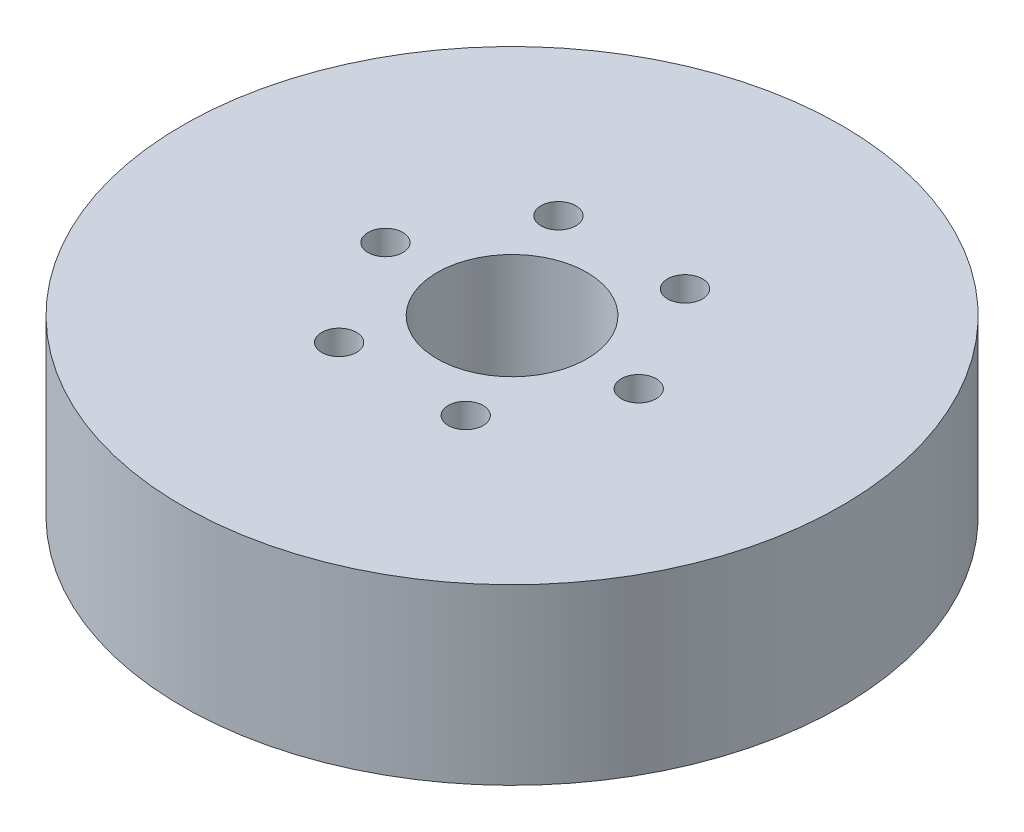
ISO-10303-21;
HEADER;
FILE_DESCRIPTION(('STEP AP214'),'2;1');
FILE_NAME('part.step','',(''),(''),'','','');
FILE_SCHEMA(('AUTOMOTIVE_DESIGN { 1 0 10303 214 1 1 1 1 }'));
ENDSEC;
DATA;
#1=APPLICATION_CONTEXT('core data for automotive mechanical design processes');
#2=APPLICATION_PROTOCOL_DEFINITION('international standard','automotive_design',2000,#1);
#3=PRODUCT_CONTEXT('',#1,'mechanical');
#4=PRODUCT('Part','Part','',(#3));
#5=PRODUCT_RELATED_PRODUCT_CATEGORY('part','',(#4));
#6=PRODUCT_DEFINITION_FORMATION('','',#4);
#7=PRODUCT_DEFINITION_CONTEXT('part definition',#1,'design');
#8=PRODUCT_DEFINITION('design','',#6,#7);
#9=PRODUCT_DEFINITION_SHAPE('','',#8);
#10=(LENGTH_UNIT() NAMED_UNIT(*) SI_UNIT(.MILLI.,.METRE.));
#11=(NAMED_UNIT(*) PLANE_ANGLE_UNIT() SI_UNIT($,.RADIAN.));
#12=(NAMED_UNIT(*) SI_UNIT($,.STERADIAN.) SOLID_ANGLE_UNIT());
#13=UNCERTAINTY_MEASURE_WITH_UNIT(LENGTH_MEASURE(1.E-05),#10,'distance_accuracy_value','');
#14=(GEOMETRIC_REPRESENTATION_CONTEXT(3) GLOBAL_UNCERTAINTY_ASSIGNED_CONTEXT((#13)) GLOBAL_UNIT_ASSIGNED_CONTEXT((#10,
#11,#12)) REPRESENTATION_CONTEXT('',''));
#15=CARTESIAN_POINT('',(0.,0.,0.));
#16=DIRECTION('',(0.,0.,1.));
#17=DIRECTION('',(1.,0.,0.));
#18=AXIS2_PLACEMENT_3D('',#15,#16,#17);
#19=CARTESIAN_POINT('',(0.,29.,0.));
#20=DIRECTION('',(0.,-1.,0.));
#21=DIRECTION('',(0.,0.,-1.));
#22=AXIS2_PLACEMENT_3D('',#19,#20,#21);
#23=CYLINDRICAL_SURFACE('',#22,55.);
#24=CARTESIAN_POINT('',(0.,29.,0.));
#25=DIRECTION('',(0.,1.,0.));
#26=DIRECTION('',(0.,0.,1.));
#27=AXIS2_PLACEMENT_3D('',#24,#25,#26);
#28=CIRCLE('',#27,55.);
#29=CARTESIAN_POINT('',(0.,29.,-55.));
#30=VERTEX_POINT('',#29);
#31=EDGE_CURVE('E10',#30,#30,#28,.T.);
#32=CARTESIAN_POINT('',(0.,0.,0.));
#33=DIRECTION('',(0.,1.,0.));
#34=DIRECTION('',(0.,0.,1.));
#35=AXIS2_PLACEMENT_3D('',#32,#33,#34);
#36=CIRCLE('',#35,55.);
#37=CARTESIAN_POINT('',(0.,0.,-55.));
#38=VERTEX_POINT('',#37);
#39=EDGE_CURVE('E37',#38,#38,#36,.T.);
#40=CARTESIAN_POINT('',(0.,29.,-55.));
#41=CARTESIAN_POINT('',(0.,28.6979166666667,-55.));
#42=CARTESIAN_POINT('',(0.,28.3958333333333,-55.));
#43=CARTESIAN_POINT('',(0.,27.7916666666667,-55.));
#44=CARTESIAN_POINT('',(0.,27.4895833333333,-55.));
#45=CARTESIAN_POINT('',(0.,26.8854166666667,-55.));
#46=CARTESIAN_POINT('',(0.,26.5833333333333,-55.));
#47=CARTESIAN_POINT('',(0.,25.9791666666667,-55.));
#48=CARTESIAN_POINT('',(0.,25.6770833333333,-55.));
#49=CARTESIAN_POINT('',(0.,25.0729166666667,-55.));
#50=CARTESIAN_POINT('',(0.,24.7708333333333,-55.));
#51=CARTESIAN_POINT('',(0.,24.1666666666667,-55.));
#52=CARTESIAN_POINT('',(0.,23.8645833333333,-55.));
#53=CARTESIAN_POINT('',(0.,23.2604166666667,-55.));
#54=CARTESIAN_POINT('',(0.,22.9583333333333,-55.));
#55=CARTESIAN_POINT('',(0.,22.3541666666667,-55.));
#56=CARTESIAN_POINT('',(0.,22.0520833333333,-55.));
#57=CARTESIAN_POINT('',(0.,21.4479166666667,-55.));
#58=CARTESIAN_POINT('',(0.,21.1458333333333,-55.));
#59=CARTESIAN_POINT('',(0.,20.5416666666667,-55.));
#60=CARTESIAN_POINT('',(0.,20.2395833333333,-55.));
#61=CARTESIAN_POINT('',(0.,19.6354166666667,-55.));
#62=CARTESIAN_POINT('',(0.,19.3333333333333,-55.));
#63=CARTESIAN_POINT('',(0.,18.7291666666667,-55.));
#64=CARTESIAN_POINT('',(0.,18.4270833333333,-55.));
#65=CARTESIAN_POINT('',(0.,17.8229166666667,-55.));
#66=CARTESIAN_POINT('',(0.,17.5208333333333,-55.));
#67=CARTESIAN_POINT('',(0.,16.9166666666667,-55.));
#68=CARTESIAN_POINT('',(0.,16.6145833333333,-55.));
#69=CARTESIAN_POINT('',(0.,16.0104166666667,-55.));
#70=CARTESIAN_POINT('',(0.,15.7083333333333,-55.));
#71=CARTESIAN_POINT('',(0.,15.1041666666667,-55.));
#72=CARTESIAN_POINT('',(0.,14.8020833333333,-55.));
#73=CARTESIAN_POINT('',(0.,14.1979166666667,-55.));
#74=CARTESIAN_POINT('',(0.,13.8958333333333,-55.));
#75=CARTESIAN_POINT('',(0.,13.2916666666667,-55.));
#76=CARTESIAN_POINT('',(0.,12.9895833333333,-55.));
#77=CARTESIAN_POINT('',(0.,12.3854166666667,-55.));
#78=CARTESIAN_POINT('',(0.,12.0833333333333,-55.));
#79=CARTESIAN_POINT('',(0.,11.4791666666667,-55.));
#80=CARTESIAN_POINT('',(0.,11.1770833333333,-55.));
#81=CARTESIAN_POINT('',(0.,10.5729166666667,-55.));
#82=CARTESIAN_POINT('',(0.,10.2708333333333,-55.));
#83=CARTESIAN_POINT('',(0.,9.66666666666667,-55.));
#84=CARTESIAN_POINT('',(0.,9.36458333333333,-55.));
#85=CARTESIAN_POINT('',(0.,8.76041666666667,-55.));
#86=CARTESIAN_POINT('',(0.,8.45833333333333,-55.));
#87=CARTESIAN_POINT('',(0.,7.85416666666667,-55.));
#88=CARTESIAN_POINT('',(0.,7.55208333333333,-55.));
#89=CARTESIAN_POINT('',(0.,6.94791666666667,-55.));
#90=CARTESIAN_POINT('',(0.,6.64583333333333,-55.));
#91=CARTESIAN_POINT('',(0.,6.04166666666667,-55.));
#92=CARTESIAN_POINT('',(0.,5.73958333333333,-55.));
#93=CARTESIAN_POINT('',(0.,5.13541666666667,-55.));
#94=CARTESIAN_POINT('',(0.,4.83333333333333,-55.));
#95=CARTESIAN_POINT('',(0.,4.22916666666667,-55.));
#96=CARTESIAN_POINT('',(0.,3.92708333333333,-55.));
#97=CARTESIAN_POINT('',(0.,3.32291666666667,-55.));
#98=CARTESIAN_POINT('',(0.,3.02083333333333,-55.));
#99=CARTESIAN_POINT('',(0.,2.41666666666667,-55.));
#100=CARTESIAN_POINT('',(0.,2.11458333333333,-55.));
#101=CARTESIAN_POINT('',(0.,1.51041666666667,-55.));
#102=CARTESIAN_POINT('',(0.,1.20833333333333,-55.));
#103=CARTESIAN_POINT('',(0.,0.604166666666667,-55.));
#104=CARTESIAN_POINT('',(0.,0.302083333333333,-55.));
#105=CARTESIAN_POINT('',(0.,0.,-55.));
#106=B_SPLINE_CURVE_WITH_KNOTS('',3,(#40,#41,#42,#43,#44,#45,#46,#47,#48,#49,#50,#51,#52,#53,
#54,#55,#56,#57,#58,#59,#60,#61,#62,#63,#64,#65,#66,#67,#68,#69,#70,#71,#72,#73,#74,#75,#76,#77,
#78,#79,#80,#81,#82,#83,#84,#85,#86,#87,#88,#89,#90,#91,#92,#93,#94,#95,#96,#97,#98,#99,#100,
#101,#102,#103,#104,#105),.UNSPECIFIED.,.F.,.F.,(4,2,2,2,2,2,2,2,2,2,2,2,2,2,2,2,2,2,2,2,2,2,2,
2,2,2,2,2,2,2,2,2,4),(0.,0.906250000000001,1.8125,2.71875,3.625,4.53125,5.4375,6.34375,7.25,
8.15625,9.0625,9.96875,10.875,11.78125,12.6875,13.59375,14.5,15.40625,16.3125,17.21875,18.125,
19.03125,19.9375,20.84375,21.75,22.65625,23.5625,24.46875,25.375,26.28125,27.1875,28.09375,29.),.UNSPECIFIED.);
#107=EDGE_CURVE('BSEAM40',#30,#38,#106,.T.);
#108=ORIENTED_EDGE('',*,*,#31,.F.);
#109=ORIENTED_EDGE('',*,*,#39,.T.);
#110=ORIENTED_EDGE('',*,*,#107,.T.);
#111=ORIENTED_EDGE('',*,*,#107,.F.);
#112=EDGE_LOOP('',(#108,#110,#109,#111));
#113=FACE_BOUND('',#112,.T.);
#114=ADVANCED_FACE('F40',(#113),#23,.T.);
#115=CARTESIAN_POINT('',(0.,29.,0.));
#116=DIRECTION('',(0.,1.,0.));
#117=DIRECTION('',(0.,0.,1.));
#118=AXIS2_PLACEMENT_3D('',#115,#116,#117);
#119=PLANE('',#118);
#120=CARTESIAN_POINT('',(-10.5650806041825,29.,-18.2992563925041));
#121=DIRECTION('',(0.,1.,0.));
#122=DIRECTION('',(-0.866025403784433,0.,0.50000000000001));
#123=AXIS2_PLACEMENT_3D('',#120,#121,#122);
#124=CIRCLE('',#123,2.91067719214933);
#125=CARTESIAN_POINT('',(-13.0858009947998,29.,-16.8439177964294));
#126=VERTEX_POINT('',#125);
#127=EDGE_CURVE('E70',#126,#126,#124,.T.);
#128=ORIENTED_EDGE('',*,*,#127,.F.);
#129=EDGE_LOOP('',(#128));
#130=FACE_BOUND('',#129,.T.);
#131=CARTESIAN_POINT('',(10.5650806041821,29.,-18.2992563925043));
#132=DIRECTION('',(0.,1.,0.));
#133=DIRECTION('',(-0.866025403784443,0.,-0.499999999999992));
#134=AXIS2_PLACEMENT_3D('',#131,#132,#133);
#135=CIRCLE('',#134,2.91067719214933);
#136=CARTESIAN_POINT('',(8.04436021356485,29.,-19.754594988579));
#137=VERTEX_POINT('',#136);
#138=EDGE_CURVE('E71',#137,#137,#135,.T.);
#139=ORIENTED_EDGE('',*,*,#138,.F.);
#140=EDGE_LOOP('',(#139));
#141=FACE_BOUND('',#140,.T.);
#142=CARTESIAN_POINT('',(21.1301612083646,29.,0.));
#143=DIRECTION('',(0.,1.,0.));
#144=DIRECTION('',(0.,0.,-1.));
#145=AXIS2_PLACEMENT_3D('',#142,#143,#144);
#146=CIRCLE('',#145,2.91067719214933);
#147=CARTESIAN_POINT('',(21.1301612083646,29.,-2.91067719214933));
#148=VERTEX_POINT('',#147);
#149=EDGE_CURVE('E78',#148,#148,#146,.T.);
#150=ORIENTED_EDGE('',*,*,#149,.F.);
#151=EDGE_LOOP('',(#150));
#152=FACE_BOUND('',#151,.T.);
#153=CARTESIAN_POINT('',(10.5650806041824,29.,18.2992563925042));
#154=DIRECTION('',(0.,1.,0.));
#155=DIRECTION('',(0.866025403784436,0.,-0.500000000000004));
#156=AXIS2_PLACEMENT_3D('',#153,#154,#155);
#157=CIRCLE('',#156,2.91067719214933);
#158=CARTESIAN_POINT('',(13.0858009947997,29.,16.8439177964295));
#159=VERTEX_POINT('',#158);
#160=EDGE_CURVE('E84',#159,#159,#157,.T.);
#161=ORIENTED_EDGE('',*,*,#160,.F.);
#162=EDGE_LOOP('',(#161));
#163=FACE_BOUND('',#162,.T.);
#164=CARTESIAN_POINT('',(-10.5650806041823,29.,18.2992563925043));
#165=DIRECTION('',(0.,1.,0.));
#166=DIRECTION('',(0.86602540378444,0.,0.499999999999998));
#167=AXIS2_PLACEMENT_3D('',#164,#165,#166);
#168=CIRCLE('',#167,2.91067719214933);
#169=CARTESIAN_POINT('',(-8.04436021356499,29.,19.7545949885789));
#170=VERTEX_POINT('',#169);
#171=EDGE_CURVE('E61',#170,#170,#168,.T.);
#172=ORIENTED_EDGE('',*,*,#171,.F.);
#173=EDGE_LOOP('',(#172));
#174=FACE_BOUND('',#173,.T.);
#175=CARTESIAN_POINT('',(-21.1301612083646,29.,0.));
#176=DIRECTION('',(0.,1.,0.));
#177=DIRECTION('',(0.,0.,1.));
#178=AXIS2_PLACEMENT_3D('',#175,#176,#177);
#179=CIRCLE('',#178,2.91067719214933);
#180=CARTESIAN_POINT('',(-21.1301612083646,29.,2.91067719214933));
#181=VERTEX_POINT('',#180);
#182=EDGE_CURVE('E54',#181,#181,#179,.T.);
#183=ORIENTED_EDGE('',*,*,#182,.F.);
#184=EDGE_LOOP('',(#183));
#185=FACE_BOUND('',#184,.T.);
#186=CARTESIAN_POINT('',(0.,29.,0.));
#187=DIRECTION('',(0.,1.,0.));
#188=DIRECTION('',(0.,0.,1.));
#189=AXIS2_PLACEMENT_3D('',#186,#187,#188);
#190=CIRCLE('',#189,12.5);
#191=CARTESIAN_POINT('',(0.,29.,-12.5));
#192=VERTEX_POINT('',#191);
#193=EDGE_CURVE('E50',#192,#192,#190,.T.);
#194=ORIENTED_EDGE('',*,*,#193,.F.);
#195=EDGE_LOOP('',(#194));
#196=FACE_BOUND('',#195,.T.);
#197=ORIENTED_EDGE('',*,*,#31,.T.);
#198=EDGE_LOOP('',(#197));
#199=FACE_BOUND('',#198,.T.);
#200=ADVANCED_FACE('F99',(#130,#141,#152,#163,#174,#185,#196,#199),#119,.T.);
#201=CARTESIAN_POINT('',(0.,0.,0.));
#202=DIRECTION('',(0.,1.,0.));
#203=DIRECTION('',(0.,0.,1.));
#204=AXIS2_PLACEMENT_3D('',#201,#202,#203);
#205=PLANE('',#204);
#206=CARTESIAN_POINT('',(0.,0.,0.));
#207=DIRECTION('',(0.,1.,0.));
#208=DIRECTION('',(0.,0.,1.));
#209=AXIS2_PLACEMENT_3D('',#206,#207,#208);
#210=CIRCLE('',#209,12.5);
#211=CARTESIAN_POINT('',(0.,0.,-12.5));
#212=VERTEX_POINT('',#211);
#213=EDGE_CURVE('E47',#212,#212,#210,.T.);
#214=ORIENTED_EDGE('',*,*,#213,.T.);
#215=EDGE_LOOP('',(#214));
#216=FACE_BOUND('',#215,.T.);
#217=ORIENTED_EDGE('',*,*,#39,.F.);
#218=EDGE_LOOP('',(#217));
#219=FACE_BOUND('',#218,.T.);
#220=ADVANCED_FACE('F103',(#216,#219),#205,.F.);
#221=CARTESIAN_POINT('',(0.,29.,0.));
#222=DIRECTION('',(0.,-1.,0.));
#223=DIRECTION('',(0.,0.,-1.));
#224=AXIS2_PLACEMENT_3D('',#221,#222,#223);
#225=CYLINDRICAL_SURFACE('',#224,12.5);
#226=CARTESIAN_POINT('',(0.,29.,-12.5));
#227=CARTESIAN_POINT('',(0.,28.6979166666667,-12.5));
#228=CARTESIAN_POINT('',(0.,28.3958333333333,-12.5));
#229=CARTESIAN_POINT('',(0.,27.7916666666667,-12.5));
#230=CARTESIAN_POINT('',(0.,27.4895833333333,-12.5));
#231=CARTESIAN_POINT('',(0.,26.8854166666667,-12.5));
#232=CARTESIAN_POINT('',(0.,26.5833333333333,-12.5));
#233=CARTESIAN_POINT('',(0.,25.9791666666667,-12.5));
#234=CARTESIAN_POINT('',(0.,25.6770833333333,-12.5));
#235=CARTESIAN_POINT('',(0.,25.0729166666667,-12.5));
#236=CARTESIAN_POINT('',(0.,24.7708333333333,-12.5));
#237=CARTESIAN_POINT('',(0.,24.1666666666667,-12.5));
#238=CARTESIAN_POINT('',(0.,23.8645833333333,-12.5));
#239=CARTESIAN_POINT('',(0.,23.2604166666667,-12.5));
#240=CARTESIAN_POINT('',(0.,22.9583333333333,-12.5));
#241=CARTESIAN_POINT('',(0.,22.3541666666667,-12.5));
#242=CARTESIAN_POINT('',(0.,22.0520833333333,-12.5));
#243=CARTESIAN_POINT('',(0.,21.4479166666667,-12.5));
#244=CARTESIAN_POINT('',(0.,21.1458333333333,-12.5));
#245=CARTESIAN_POINT('',(0.,20.5416666666667,-12.5));
#246=CARTESIAN_POINT('',(0.,20.2395833333333,-12.5));
#247=CARTESIAN_POINT('',(0.,19.6354166666667,-12.5));
#248=CARTESIAN_POINT('',(0.,19.3333333333333,-12.5));
#249=CARTESIAN_POINT('',(0.,18.7291666666667,-12.5));
#250=CARTESIAN_POINT('',(0.,18.4270833333333,-12.5));
#251=CARTESIAN_POINT('',(0.,17.8229166666667,-12.5));
#252=CARTESIAN_POINT('',(0.,17.5208333333333,-12.5));
#253=CARTESIAN_POINT('',(0.,16.9166666666667,-12.5));
#254=CARTESIAN_POINT('',(0.,16.6145833333333,-12.5));
#255=CARTESIAN_POINT('',(0.,16.0104166666667,-12.5));
#256=CARTESIAN_POINT('',(0.,15.7083333333333,-12.5));
#257=CARTESIAN_POINT('',(0.,15.1041666666667,-12.5));
#258=CARTESIAN_POINT('',(0.,14.8020833333333,-12.5));
#259=CARTESIAN_POINT('',(0.,14.1979166666667,-12.5));
#260=CARTESIAN_POINT('',(0.,13.8958333333333,-12.5));
#261=CARTESIAN_POINT('',(0.,13.2916666666667,-12.5));
#262=CARTESIAN_POINT('',(0.,12.9895833333333,-12.5));
#263=CARTESIAN_POINT('',(0.,12.3854166666667,-12.5));
#264=CARTESIAN_POINT('',(0.,12.0833333333333,-12.5));
#265=CARTESIAN_POINT('',(0.,11.4791666666667,-12.5));
#266=CARTESIAN_POINT('',(0.,11.1770833333333,-12.5));
#267=CARTESIAN_POINT('',(0.,10.5729166666667,-12.5));
#268=CARTESIAN_POINT('',(0.,10.2708333333333,-12.5));
#269=CARTESIAN_POINT('',(0.,9.66666666666667,-12.5));
#270=CARTESIAN_POINT('',(0.,9.36458333333333,-12.5));
#271=CARTESIAN_POINT('',(0.,8.76041666666667,-12.5));
#272=CARTESIAN_POINT('',(0.,8.45833333333333,-12.5));
#273=CARTESIAN_POINT('',(0.,7.85416666666667,-12.5));
#274=CARTESIAN_POINT('',(0.,7.55208333333333,-12.5));
#275=CARTESIAN_POINT('',(0.,6.94791666666667,-12.5));
#276=CARTESIAN_POINT('',(0.,6.64583333333333,-12.5));
#277=CARTESIAN_POINT('',(0.,6.04166666666667,-12.5));
#278=CARTESIAN_POINT('',(0.,5.73958333333333,-12.5));
#279=CARTESIAN_POINT('',(0.,5.13541666666667,-12.5));
#280=CARTESIAN_POINT('',(0.,4.83333333333333,-12.5));
#281=CARTESIAN_POINT('',(0.,4.22916666666667,-12.5));
#282=CARTESIAN_POINT('',(0.,3.92708333333333,-12.5));
#283=CARTESIAN_POINT('',(0.,3.32291666666667,-12.5));
#284=CARTESIAN_POINT('',(0.,3.02083333333333,-12.5));
#285=CARTESIAN_POINT('',(0.,2.41666666666667,-12.5));
#286=CARTESIAN_POINT('',(0.,2.11458333333333,-12.5));
#287=CARTESIAN_POINT('',(0.,1.51041666666667,-12.5));
#288=CARTESIAN_POINT('',(0.,1.20833333333333,-12.5));
#289=CARTESIAN_POINT('',(0.,0.604166666666667,-12.5));
#290=CARTESIAN_POINT('',(0.,0.302083333333333,-12.5));
#291=CARTESIAN_POINT('',(0.,0.,-12.5));
#292=B_SPLINE_CURVE_WITH_KNOTS('',3,(#226,#227,#228,#229,#230,#231,#232,#233,#234,#235,#236,
#237,#238,#239,#240,#241,#242,#243,#244,#245,#246,#247,#248,#249,#250,#251,#252,#253,#254,#255,
#256,#257,#258,#259,#260,#261,#262,#263,#264,#265,#266,#267,#268,#269,#270,#271,#272,#273,#274,
#275,#276,#277,#278,#279,#280,#281,#282,#283,#284,#285,#286,#287,#288,#289,#290,#291),
.UNSPECIFIED.,.F.,.F.,(4,2,2,2,2,2,2,2,2,2,2,2,2,2,2,2,2,2,2,2,2,2,2,2,2,2,2,2,2,2,2,2,4),(0.,
0.906250000000001,1.8125,2.71875,3.625,4.53125,5.4375,6.34375,7.25,8.15625,9.0625,9.96875,
10.875,11.78125,12.6875,13.59375,14.5,15.40625,16.3125,17.21875,18.125,19.03125,19.9375,
20.84375,21.75,22.65625,23.5625,24.46875,25.375,26.28125,27.1875,28.09375,29.),.UNSPECIFIED.);
#293=EDGE_CURVE('BSEAM115',#192,#212,#292,.T.);
#294=ORIENTED_EDGE('',*,*,#193,.T.);
#295=ORIENTED_EDGE('',*,*,#213,.F.);
#296=ORIENTED_EDGE('',*,*,#293,.T.);
#297=ORIENTED_EDGE('',*,*,#293,.F.);
#298=EDGE_LOOP('',(#294,#296,#295,#297));
#299=FACE_BOUND('',#298,.T.);
#300=ADVANCED_FACE('F115',(#299),#225,.F.);
#301=CARTESIAN_POINT('',(-21.1301612083646,3.08403833342558,0.));
#302=DIRECTION('',(0.,1.,0.));
#303=DIRECTION('',(0.,0.,1.));
#304=AXIS2_PLACEMENT_3D('',#301,#302,#303);
#305=CYLINDRICAL_SURFACE('',#304,2.91067719214933);
#306=CARTESIAN_POINT('',(-21.1301612083646,3.08403833342558,0.));
#307=DIRECTION('',(0.,1.,0.));
#308=DIRECTION('',(0.,0.,1.));
#309=AXIS2_PLACEMENT_3D('',#306,#307,#308);
#310=CIRCLE('',#309,2.91067719214933);
#311=CARTESIAN_POINT('',(-21.1301612083646,3.08403833342558,2.91067719214933));
#312=VERTEX_POINT('',#311);
#313=EDGE_CURVE('E55',#312,#312,#310,.T.);
#314=ORIENTED_EDGE('',*,*,#313,.F.);
#315=EDGE_LOOP('',(#314));
#316=FACE_BOUND('',#315,.T.);
#317=ORIENTED_EDGE('',*,*,#182,.T.);
#318=EDGE_LOOP('',(#317));
#319=FACE_BOUND('',#318,.T.);
#320=ADVANCED_FACE('F113',(#316,#319),#305,.F.);
#321=CARTESIAN_POINT('',(-21.1301612083646,3.08403833342558,0.));
#322=DIRECTION('',(0.,1.,0.));
#323=DIRECTION('',(0.,0.,1.));
#324=AXIS2_PLACEMENT_3D('',#321,#322,#323);
#325=PLANE('',#324);
#326=ORIENTED_EDGE('',*,*,#313,.T.);
#327=EDGE_LOOP('',(#326));
#328=FACE_BOUND('',#327,.T.);
#329=ADVANCED_FACE('F144',(#328),#325,.T.);
#330=CARTESIAN_POINT('',(-10.5650806041823,3.08403833342558,18.2992563925043));
#331=DIRECTION('',(0.,1.,0.));
#332=DIRECTION('',(0.,0.,1.));
#333=AXIS2_PLACEMENT_3D('',#330,#331,#332);
#334=CYLINDRICAL_SURFACE('',#333,2.91067719214933);
#335=CARTESIAN_POINT('',(-10.5650806041823,3.08403833342558,18.2992563925043));
#336=DIRECTION('',(0.,1.,0.));
#337=DIRECTION('',(0.86602540378444,0.,0.499999999999998));
#338=AXIS2_PLACEMENT_3D('',#335,#336,#337);
#339=CIRCLE('',#338,2.91067719214933);
#340=CARTESIAN_POINT('',(-8.04436021356499,3.08403833342558,19.7545949885789));
#341=VERTEX_POINT('',#340);
#342=EDGE_CURVE('E59',#341,#341,#339,.T.);
#343=ORIENTED_EDGE('',*,*,#342,.F.);
#344=EDGE_LOOP('',(#343));
#345=FACE_BOUND('',#344,.T.);
#346=ORIENTED_EDGE('',*,*,#171,.T.);
#347=EDGE_LOOP('',(#346));
#348=FACE_BOUND('',#347,.T.);
#349=ADVANCED_FACE('F153',(#345,#348),#334,.F.);
#350=CARTESIAN_POINT('',(-10.5650806041823,3.08403833342558,18.2992563925043));
#351=DIRECTION('',(0.,1.,0.));
#352=DIRECTION('',(0.86602540378444,0.,0.499999999999998));
#353=AXIS2_PLACEMENT_3D('',#350,#351,#352);
#354=PLANE('',#353);
#355=ORIENTED_EDGE('',*,*,#342,.T.);
#356=EDGE_LOOP('',(#355));
#357=FACE_BOUND('',#356,.T.);
#358=ADVANCED_FACE('F96',(#357),#354,.T.);
#359=CARTESIAN_POINT('',(10.5650806041824,3.08403833342558,18.2992563925042));
#360=DIRECTION('',(0.,1.,0.));
#361=DIRECTION('',(0.,0.,1.));
#362=AXIS2_PLACEMENT_3D('',#359,#360,#361);
#363=CYLINDRICAL_SURFACE('',#362,2.91067719214933);
#364=CARTESIAN_POINT('',(10.5650806041824,3.08403833342558,18.2992563925042));
#365=DIRECTION('',(0.,1.,0.));
#366=DIRECTION('',(0.866025403784436,0.,-0.500000000000004));
#367=AXIS2_PLACEMENT_3D('',#364,#365,#366);
#368=CIRCLE('',#367,2.91067719214933);
#369=CARTESIAN_POINT('',(13.0858009947997,3.08403833342558,16.8439177964295));
#370=VERTEX_POINT('',#369);
#371=EDGE_CURVE('E63',#370,#370,#368,.T.);
#372=ORIENTED_EDGE('',*,*,#371,.F.);
#373=EDGE_LOOP('',(#372));
#374=FACE_BOUND('',#373,.T.);
#375=ORIENTED_EDGE('',*,*,#160,.T.);
#376=EDGE_LOOP('',(#375));
#377=FACE_BOUND('',#376,.T.);
#378=ADVANCED_FACE('F91',(#374,#377),#363,.F.);
#379=CARTESIAN_POINT('',(10.5650806041824,3.08403833342558,18.2992563925042));
#380=DIRECTION('',(0.,1.,0.));
#381=DIRECTION('',(0.866025403784436,0.,-0.500000000000004));
#382=AXIS2_PLACEMENT_3D('',#379,#380,#381);
#383=PLANE('',#382);
#384=ORIENTED_EDGE('',*,*,#371,.T.);
#385=EDGE_LOOP('',(#384));
#386=FACE_BOUND('',#385,.T.);
#387=ADVANCED_FACE('F93',(#386),#383,.T.);
#388=CARTESIAN_POINT('',(21.1301612083646,3.08403833342558,0.));
#389=DIRECTION('',(0.,1.,0.));
#390=DIRECTION('',(0.,0.,1.));
#391=AXIS2_PLACEMENT_3D('',#388,#389,#390);
#392=CYLINDRICAL_SURFACE('',#391,2.91067719214933);
#393=CARTESIAN_POINT('',(21.1301612083646,3.08403833342558,0.));
#394=DIRECTION('',(0.,1.,0.));
#395=DIRECTION('',(0.,0.,-1.));
#396=AXIS2_PLACEMENT_3D('',#393,#394,#395);
#397=CIRCLE('',#396,2.91067719214933);
#398=CARTESIAN_POINT('',(21.1301612083646,3.08403833342558,-2.91067719214933));
#399=VERTEX_POINT('',#398);
#400=EDGE_CURVE('E85',#399,#399,#397,.T.);
#401=ORIENTED_EDGE('',*,*,#400,.F.);
#402=EDGE_LOOP('',(#401));
#403=FACE_BOUND('',#402,.T.);
#404=ORIENTED_EDGE('',*,*,#149,.T.);
#405=EDGE_LOOP('',(#404));
#406=FACE_BOUND('',#405,.T.);
#407=ADVANCED_FACE('F187',(#403,#406),#392,.F.);
#408=CARTESIAN_POINT('',(21.1301612083646,3.08403833342558,0.));
#409=DIRECTION('',(0.,1.,0.));
#410=DIRECTION('',(0.,0.,-1.));
#411=AXIS2_PLACEMENT_3D('',#408,#409,#410);
#412=PLANE('',#411);
#413=ORIENTED_EDGE('',*,*,#400,.T.);
#414=EDGE_LOOP('',(#413));
#415=FACE_BOUND('',#414,.T.);
#416=ADVANCED_FACE('F198',(#415),#412,.T.);
#417=CARTESIAN_POINT('',(10.5650806041821,3.08403833342558,-18.2992563925043));
#418=DIRECTION('',(0.,1.,0.));
#419=DIRECTION('',(0.,0.,1.));
#420=AXIS2_PLACEMENT_3D('',#417,#418,#419);
#421=CYLINDRICAL_SURFACE('',#420,2.91067719214933);
#422=CARTESIAN_POINT('',(10.5650806041821,3.08403833342558,-18.2992563925043));
#423=DIRECTION('',(0.,1.,0.));
#424=DIRECTION('',(-0.866025403784443,0.,-0.499999999999992));
#425=AXIS2_PLACEMENT_3D('',#422,#423,#424);
#426=CIRCLE('',#425,2.91067719214933);
#427=CARTESIAN_POINT('',(8.04436021356485,3.08403833342558,-19.754594988579));
#428=VERTEX_POINT('',#427);
#429=EDGE_CURVE('E76',#428,#428,#426,.T.);
#430=ORIENTED_EDGE('',*,*,#429,.F.);
#431=EDGE_LOOP('',(#430));
#432=FACE_BOUND('',#431,.T.);
#433=ORIENTED_EDGE('',*,*,#138,.T.);
#434=EDGE_LOOP('',(#433));
#435=FACE_BOUND('',#434,.T.);
#436=ADVANCED_FACE('F202',(#432,#435),#421,.F.);
#437=CARTESIAN_POINT('',(10.5650806041821,3.08403833342558,-18.2992563925043));
#438=DIRECTION('',(0.,1.,0.));
#439=DIRECTION('',(-0.866025403784443,0.,-0.499999999999992));
#440=AXIS2_PLACEMENT_3D('',#437,#438,#439);
#441=PLANE('',#440);
#442=ORIENTED_EDGE('',*,*,#429,.T.);
#443=EDGE_LOOP('',(#442));
#444=FACE_BOUND('',#443,.T.);
#445=ADVANCED_FACE('F212',(#444),#441,.T.);
#446=CARTESIAN_POINT('',(-10.5650806041825,3.08403833342558,-18.2992563925041));
#447=DIRECTION('',(0.,1.,0.));
#448=DIRECTION('',(0.,0.,1.));
#449=AXIS2_PLACEMENT_3D('',#446,#447,#448);
#450=CYLINDRICAL_SURFACE('',#449,2.91067719214933);
#451=CARTESIAN_POINT('',(-10.5650806041825,3.08403833342558,-18.2992563925041));
#452=DIRECTION('',(0.,1.,0.));
#453=DIRECTION('',(-0.866025403784433,0.,0.50000000000001));
#454=AXIS2_PLACEMENT_3D('',#451,#452,#453);
#455=CIRCLE('',#454,2.91067719214933);
#456=CARTESIAN_POINT('',(-13.0858009947998,3.08403833342558,-16.8439177964294));
#457=VERTEX_POINT('',#456);
#458=EDGE_CURVE('E69',#457,#457,#455,.T.);
#459=ORIENTED_EDGE('',*,*,#458,.F.);
#460=EDGE_LOOP('',(#459));
#461=FACE_BOUND('',#460,.T.);
#462=ORIENTED_EDGE('',*,*,#127,.T.);
#463=EDGE_LOOP('',(#462));
#464=FACE_BOUND('',#463,.T.);
#465=ADVANCED_FACE('F224',(#461,#464),#450,.F.);
#466=CARTESIAN_POINT('',(-10.5650806041825,3.08403833342558,-18.2992563925041));
#467=DIRECTION('',(0.,1.,0.));
#468=DIRECTION('',(-0.866025403784433,0.,0.50000000000001));
#469=AXIS2_PLACEMENT_3D('',#466,#467,#468);
#470=PLANE('',#469);
#471=ORIENTED_EDGE('',*,*,#458,.T.);
#472=EDGE_LOOP('',(#471));
#473=FACE_BOUND('',#472,.T.);
#474=ADVANCED_FACE('F235',(#473),#470,.T.);
#475=CLOSED_SHELL('',(#114,#200,#220,#300,#320,#329,#349,#358,#378,#387,#407,#416,#436,#445,
#465,#474));
#476=MANIFOLD_SOLID_BREP('B2',#475);
#477=ADVANCED_BREP_SHAPE_REPRESENTATION('',(#18,#476),#14);
#478=SHAPE_DEFINITION_REPRESENTATION(#9,#477);
ENDSEC;
END-ISO-10303-21;
